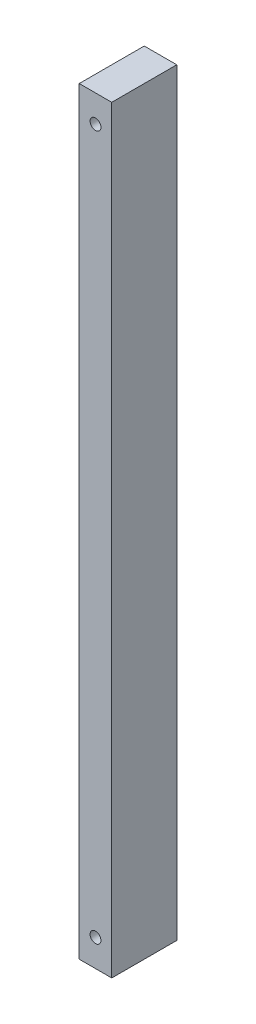
ISO-10303-21;
HEADER;
FILE_DESCRIPTION(('STEP AP214'),'2;1');
FILE_NAME('part.step','',(''),(''),'','','');
FILE_SCHEMA(('AUTOMOTIVE_DESIGN { 1 0 10303 214 1 1 1 1 }'));
ENDSEC;
DATA;
#1=APPLICATION_CONTEXT('core data for automotive mechanical design processes');
#2=APPLICATION_PROTOCOL_DEFINITION('international standard','automotive_design',2000,#1);
#3=PRODUCT_CONTEXT('',#1,'mechanical');
#4=PRODUCT('Part','Part','',(#3));
#5=PRODUCT_RELATED_PRODUCT_CATEGORY('part','',(#4));
#6=PRODUCT_DEFINITION_FORMATION('','',#4);
#7=PRODUCT_DEFINITION_CONTEXT('part definition',#1,'design');
#8=PRODUCT_DEFINITION('design','',#6,#7);
#9=PRODUCT_DEFINITION_SHAPE('','',#8);
#10=(LENGTH_UNIT() NAMED_UNIT(*) SI_UNIT(.MILLI.,.METRE.));
#11=(NAMED_UNIT(*) PLANE_ANGLE_UNIT() SI_UNIT($,.RADIAN.));
#12=(NAMED_UNIT(*) SI_UNIT($,.STERADIAN.) SOLID_ANGLE_UNIT());
#13=UNCERTAINTY_MEASURE_WITH_UNIT(LENGTH_MEASURE(1.E-05),#10,'distance_accuracy_value','');
#14=(GEOMETRIC_REPRESENTATION_CONTEXT(3) GLOBAL_UNCERTAINTY_ASSIGNED_CONTEXT((#13)) GLOBAL_UNIT_ASSIGNED_CONTEXT((#10,
#11,#12)) REPRESENTATION_CONTEXT('',''));
#15=CARTESIAN_POINT('',(0.,0.,0.));
#16=DIRECTION('',(0.,0.,1.));
#17=DIRECTION('',(1.,0.,0.));
#18=AXIS2_PLACEMENT_3D('',#15,#16,#17);
#19=CARTESIAN_POINT('',(19.05,0.,0.));
#20=DIRECTION('',(0.,0.,-1.));
#21=DIRECTION('',(-1.,0.,0.));
#22=AXIS2_PLACEMENT_3D('',#19,#20,#21);
#23=PLANE('',#22);
#24=CARTESIAN_POINT('',(9.525,428.625,0.));
#25=DIRECTION('',(0.,0.,1.));
#26=DIRECTION('',(1.,0.,0.));
#27=AXIS2_PLACEMENT_3D('',#24,#25,#26);
#28=CIRCLE('',#27,3.175);
#29=CARTESIAN_POINT('',(12.7,428.625,0.));
#30=VERTEX_POINT('',#29);
#31=EDGE_CURVE('E116',#30,#30,#28,.T.);
#32=ORIENTED_EDGE('',*,*,#31,.F.);
#33=EDGE_LOOP('',(#32));
#34=FACE_BOUND('',#33,.T.);
#35=CARTESIAN_POINT('',(9.52500000000005,15.875,0.));
#36=DIRECTION('',(0.,0.,1.));
#37=DIRECTION('',(1.,0.,0.));
#38=AXIS2_PLACEMENT_3D('',#35,#36,#37);
#39=CIRCLE('',#38,3.175);
#40=CARTESIAN_POINT('',(12.7000000000001,15.875,0.));
#41=VERTEX_POINT('',#40);
#42=EDGE_CURVE('E110',#41,#41,#39,.T.);
#43=ORIENTED_EDGE('',*,*,#42,.F.);
#44=EDGE_LOOP('',(#43));
#45=FACE_BOUND('',#44,.T.);
#46=DIRECTION('',(0.,-1.,0.));
#47=VECTOR('',#46,1.);
#48=CARTESIAN_POINT('',(0.,0.,0.));
#49=LINE('',#48,#47);
#50=CARTESIAN_POINT('',(0.,444.5,0.));
#51=VERTEX_POINT('',#50);
#52=CARTESIAN_POINT('',(0.,0.,0.));
#53=VERTEX_POINT('',#52);
#54=EDGE_CURVE('E96',#51,#53,#49,.T.);
#55=ORIENTED_EDGE('',*,*,#54,.T.);
#56=DIRECTION('',(-1.,0.,0.));
#57=VECTOR('',#56,1.);
#58=CARTESIAN_POINT('',(19.05,0.,0.));
#59=LINE('',#58,#57);
#60=CARTESIAN_POINT('',(19.05,0.,0.));
#61=VERTEX_POINT('',#60);
#62=EDGE_CURVE('E11',#61,#53,#59,.T.);
#63=ORIENTED_EDGE('',*,*,#62,.F.);
#64=DIRECTION('',(0.,-1.,0.));
#65=VECTOR('',#64,1.);
#66=CARTESIAN_POINT('',(19.05,0.,0.));
#67=LINE('',#66,#65);
#68=CARTESIAN_POINT('',(19.05,444.5,0.));
#69=VERTEX_POINT('',#68);
#70=EDGE_CURVE('E84',#69,#61,#67,.T.);
#71=ORIENTED_EDGE('',*,*,#70,.F.);
#72=DIRECTION('',(-1.,0.,0.));
#73=VECTOR('',#72,1.);
#74=CARTESIAN_POINT('',(19.05,444.5,0.));
#75=LINE('',#74,#73);
#76=EDGE_CURVE('E92',#69,#51,#75,.T.);
#77=ORIENTED_EDGE('',*,*,#76,.T.);
#78=EDGE_LOOP('',(#55,#63,#71,#77));
#79=FACE_BOUND('',#78,.T.);
#80=ADVANCED_FACE('F33',(#34,#45,#79),#23,.F.);
#81=CARTESIAN_POINT('',(19.05,0.,0.));
#82=DIRECTION('',(0.,1.,0.));
#83=DIRECTION('',(0.,0.,1.));
#84=AXIS2_PLACEMENT_3D('',#81,#82,#83);
#85=PLANE('',#84);
#86=DIRECTION('',(0.,0.,-1.));
#87=VECTOR('',#86,1.);
#88=CARTESIAN_POINT('',(0.,0.,0.));
#89=LINE('',#88,#87);
#90=CARTESIAN_POINT('',(0.,0.,-38.1));
#91=VERTEX_POINT('',#90);
#92=EDGE_CURVE('E88',#53,#91,#89,.T.);
#93=ORIENTED_EDGE('',*,*,#92,.T.);
#94=DIRECTION('',(-1.,0.,0.));
#95=VECTOR('',#94,1.);
#96=CARTESIAN_POINT('',(19.05,0.,-38.1));
#97=LINE('',#96,#95);
#98=CARTESIAN_POINT('',(19.05,0.,-38.1));
#99=VERTEX_POINT('',#98);
#100=EDGE_CURVE('E41',#99,#91,#97,.T.);
#101=ORIENTED_EDGE('',*,*,#100,.F.);
#102=DIRECTION('',(0.,0.,-1.));
#103=VECTOR('',#102,1.);
#104=CARTESIAN_POINT('',(19.05,0.,0.));
#105=LINE('',#104,#103);
#106=EDGE_CURVE('E79',#61,#99,#105,.T.);
#107=ORIENTED_EDGE('',*,*,#106,.F.);
#108=ORIENTED_EDGE('',*,*,#62,.T.);
#109=EDGE_LOOP('',(#93,#101,#107,#108));
#110=FACE_BOUND('',#109,.T.);
#111=ADVANCED_FACE('F87',(#110),#85,.F.);
#112=CARTESIAN_POINT('',(19.05,0.,-38.1));
#113=DIRECTION('',(0.,0.,1.));
#114=DIRECTION('',(1.,0.,0.));
#115=AXIS2_PLACEMENT_3D('',#112,#113,#114);
#116=PLANE('',#115);
#117=CARTESIAN_POINT('',(9.525,428.625,-38.1));
#118=DIRECTION('',(0.,0.,1.));
#119=DIRECTION('',(1.,0.,0.));
#120=AXIS2_PLACEMENT_3D('',#117,#118,#119);
#121=CIRCLE('',#120,3.175);
#122=CARTESIAN_POINT('',(12.7,428.625,-38.1));
#123=VERTEX_POINT('',#122);
#124=EDGE_CURVE('E113',#123,#123,#121,.T.);
#125=ORIENTED_EDGE('',*,*,#124,.T.);
#126=EDGE_LOOP('',(#125));
#127=FACE_BOUND('',#126,.T.);
#128=CARTESIAN_POINT('',(9.52500000000005,15.875,-38.1));
#129=DIRECTION('',(0.,0.,1.));
#130=DIRECTION('',(1.,0.,0.));
#131=AXIS2_PLACEMENT_3D('',#128,#129,#130);
#132=CIRCLE('',#131,3.175);
#133=CARTESIAN_POINT('',(12.7000000000001,15.875,-38.1));
#134=VERTEX_POINT('',#133);
#135=EDGE_CURVE('E99',#134,#134,#132,.T.);
#136=ORIENTED_EDGE('',*,*,#135,.T.);
#137=EDGE_LOOP('',(#136));
#138=FACE_BOUND('',#137,.T.);
#139=DIRECTION('',(0.,1.,0.));
#140=VECTOR('',#139,1.);
#141=CARTESIAN_POINT('',(0.,0.,-38.1));
#142=LINE('',#141,#140);
#143=CARTESIAN_POINT('',(0.,444.5,-38.1));
#144=VERTEX_POINT('',#143);
#145=EDGE_CURVE('E66',#91,#144,#142,.T.);
#146=ORIENTED_EDGE('',*,*,#145,.T.);
#147=DIRECTION('',(-1.,0.,0.));
#148=VECTOR('',#147,1.);
#149=CARTESIAN_POINT('',(19.05,444.5,-38.1));
#150=LINE('',#149,#148);
#151=CARTESIAN_POINT('',(19.05,444.5,-38.1));
#152=VERTEX_POINT('',#151);
#153=EDGE_CURVE('E89',#152,#144,#150,.T.);
#154=ORIENTED_EDGE('',*,*,#153,.F.);
#155=DIRECTION('',(0.,1.,0.));
#156=VECTOR('',#155,1.);
#157=CARTESIAN_POINT('',(19.05,0.,-38.1));
#158=LINE('',#157,#156);
#159=EDGE_CURVE('E82',#99,#152,#158,.T.);
#160=ORIENTED_EDGE('',*,*,#159,.F.);
#161=ORIENTED_EDGE('',*,*,#100,.T.);
#162=EDGE_LOOP('',(#146,#154,#160,#161));
#163=FACE_BOUND('',#162,.T.);
#164=ADVANCED_FACE('F90',(#127,#138,#163),#116,.F.);
#165=CARTESIAN_POINT('',(19.05,444.5,0.));
#166=DIRECTION('',(0.,-1.,0.));
#167=DIRECTION('',(0.,0.,-1.));
#168=AXIS2_PLACEMENT_3D('',#165,#166,#167);
#169=PLANE('',#168);
#170=DIRECTION('',(0.,0.,1.));
#171=VECTOR('',#170,1.);
#172=CARTESIAN_POINT('',(0.,444.5,0.));
#173=LINE('',#172,#171);
#174=EDGE_CURVE('E72',#144,#51,#173,.T.);
#175=ORIENTED_EDGE('',*,*,#174,.T.);
#176=ORIENTED_EDGE('',*,*,#76,.F.);
#177=DIRECTION('',(0.,0.,1.));
#178=VECTOR('',#177,1.);
#179=CARTESIAN_POINT('',(19.05,444.5,0.));
#180=LINE('',#179,#178);
#181=EDGE_CURVE('E49',#152,#69,#180,.T.);
#182=ORIENTED_EDGE('',*,*,#181,.F.);
#183=ORIENTED_EDGE('',*,*,#153,.T.);
#184=EDGE_LOOP('',(#175,#176,#182,#183));
#185=FACE_BOUND('',#184,.T.);
#186=ADVANCED_FACE('F104',(#185),#169,.F.);
#187=CARTESIAN_POINT('',(19.05,0.,0.));
#188=DIRECTION('',(-1.,0.,0.));
#189=DIRECTION('',(0.,0.,1.));
#190=AXIS2_PLACEMENT_3D('',#187,#188,#189);
#191=PLANE('',#190);
#192=ORIENTED_EDGE('',*,*,#70,.T.);
#193=ORIENTED_EDGE('',*,*,#106,.T.);
#194=ORIENTED_EDGE('',*,*,#159,.T.);
#195=ORIENTED_EDGE('',*,*,#181,.T.);
#196=EDGE_LOOP('',(#192,#193,#194,#195));
#197=FACE_BOUND('',#196,.T.);
#198=ADVANCED_FACE('F80',(#197),#191,.F.);
#199=CARTESIAN_POINT('',(0.,0.,0.));
#200=DIRECTION('',(-1.,0.,0.));
#201=DIRECTION('',(0.,0.,1.));
#202=AXIS2_PLACEMENT_3D('',#199,#200,#201);
#203=PLANE('',#202);
#204=ORIENTED_EDGE('',*,*,#54,.F.);
#205=ORIENTED_EDGE('',*,*,#174,.F.);
#206=ORIENTED_EDGE('',*,*,#145,.F.);
#207=ORIENTED_EDGE('',*,*,#92,.F.);
#208=EDGE_LOOP('',(#204,#205,#206,#207));
#209=FACE_BOUND('',#208,.T.);
#210=ADVANCED_FACE('F107',(#209),#203,.T.);
#211=CARTESIAN_POINT('',(9.52500000000005,15.875,-38.1));
#212=DIRECTION('',(0.,0.,1.));
#213=DIRECTION('',(1.,0.,0.));
#214=AXIS2_PLACEMENT_3D('',#211,#212,#213);
#215=CYLINDRICAL_SURFACE('',#214,3.175);
#216=ORIENTED_EDGE('',*,*,#135,.F.);
#217=EDGE_LOOP('',(#216));
#218=FACE_BOUND('',#217,.T.);
#219=ORIENTED_EDGE('',*,*,#42,.T.);
#220=EDGE_LOOP('',(#219));
#221=FACE_BOUND('',#220,.T.);
#222=ADVANCED_FACE('F127',(#218,#221),#215,.F.);
#223=CARTESIAN_POINT('',(9.525,428.625,-38.1));
#224=DIRECTION('',(0.,0.,1.));
#225=DIRECTION('',(1.,0.,0.));
#226=AXIS2_PLACEMENT_3D('',#223,#224,#225);
#227=CYLINDRICAL_SURFACE('',#226,3.175);
#228=ORIENTED_EDGE('',*,*,#124,.F.);
#229=EDGE_LOOP('',(#228));
#230=FACE_BOUND('',#229,.T.);
#231=ORIENTED_EDGE('',*,*,#31,.T.);
#232=EDGE_LOOP('',(#231));
#233=FACE_BOUND('',#232,.T.);
#234=ADVANCED_FACE('F124',(#230,#233),#227,.F.);
#235=CLOSED_SHELL('',(#80,#111,#164,#186,#198,#210,#222,#234));
#236=MANIFOLD_SOLID_BREP('B2',#235);
#237=ADVANCED_BREP_SHAPE_REPRESENTATION('',(#18,#236),#14);
#238=SHAPE_DEFINITION_REPRESENTATION(#9,#237);
ENDSEC;
END-ISO-10303-21;
